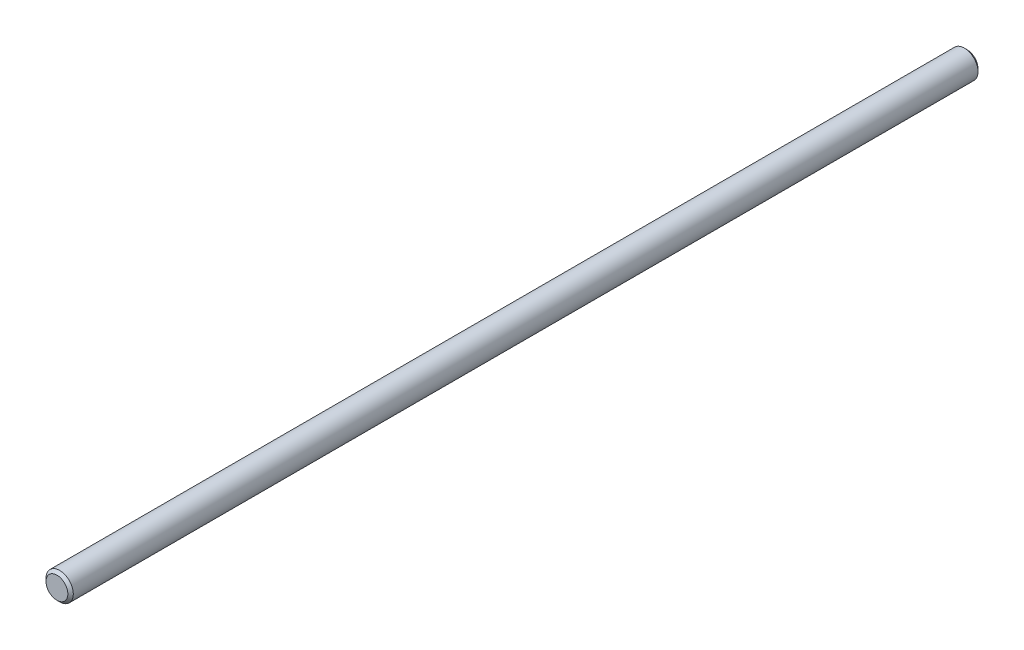
ISO-10303-21;
HEADER;
FILE_DESCRIPTION(('STEP AP214'),'2;1');
FILE_NAME('part.step','',(''),(''),'','','');
FILE_SCHEMA(('AUTOMOTIVE_DESIGN { 1 0 10303 214 1 1 1 1 }'));
ENDSEC;
DATA;
#1=APPLICATION_CONTEXT('core data for automotive mechanical design processes');
#2=APPLICATION_PROTOCOL_DEFINITION('international standard','automotive_design',2000,#1);
#3=PRODUCT_CONTEXT('',#1,'mechanical');
#4=PRODUCT('Part','Part','',(#3));
#5=PRODUCT_RELATED_PRODUCT_CATEGORY('part','',(#4));
#6=PRODUCT_DEFINITION_FORMATION('','',#4);
#7=PRODUCT_DEFINITION_CONTEXT('part definition',#1,'design');
#8=PRODUCT_DEFINITION('design','',#6,#7);
#9=PRODUCT_DEFINITION_SHAPE('','',#8);
#10=(LENGTH_UNIT() NAMED_UNIT(*) SI_UNIT(.MILLI.,.METRE.));
#11=(NAMED_UNIT(*) PLANE_ANGLE_UNIT() SI_UNIT($,.RADIAN.));
#12=(NAMED_UNIT(*) SI_UNIT($,.STERADIAN.) SOLID_ANGLE_UNIT());
#13=UNCERTAINTY_MEASURE_WITH_UNIT(LENGTH_MEASURE(1.E-05),#10,'distance_accuracy_value','');
#14=(GEOMETRIC_REPRESENTATION_CONTEXT(3) GLOBAL_UNCERTAINTY_ASSIGNED_CONTEXT((#13)) GLOBAL_UNIT_ASSIGNED_CONTEXT((#10,
#11,#12)) REPRESENTATION_CONTEXT('',''));
#15=CARTESIAN_POINT('',(0.,0.,0.));
#16=DIRECTION('',(0.,0.,1.));
#17=DIRECTION('',(1.,0.,0.));
#18=AXIS2_PLACEMENT_3D('',#15,#16,#17);
#19=CARTESIAN_POINT('',(0.,0.,200.));
#20=DIRECTION('',(0.,0.,-1.));
#21=DIRECTION('',(-1.,0.,0.));
#22=AXIS2_PLACEMENT_3D('',#19,#20,#21);
#23=CYLINDRICAL_SURFACE('',#22,6.);
#24=CARTESIAN_POINT('',(0.,0.,-198.8));
#25=DIRECTION('',(0.,0.,1.));
#26=DIRECTION('',(1.,0.,0.));
#27=AXIS2_PLACEMENT_3D('',#24,#25,#26);
#28=CIRCLE('',#27,6.);
#29=CARTESIAN_POINT('',(6.,0.,-198.8));
#30=VERTEX_POINT('',#29);
#31=EDGE_CURVE('E41',#30,#30,#28,.T.);
#32=ORIENTED_EDGE('',*,*,#31,.T.);
#33=EDGE_LOOP('',(#32));
#34=FACE_BOUND('',#33,.T.);
#35=CARTESIAN_POINT('',(0.,0.,198.8));
#36=DIRECTION('',(0.,0.,1.));
#37=DIRECTION('',(1.,0.,0.));
#38=AXIS2_PLACEMENT_3D('',#35,#36,#37);
#39=CIRCLE('',#38,6.);
#40=CARTESIAN_POINT('',(6.,0.,198.8));
#41=VERTEX_POINT('',#40);
#42=EDGE_CURVE('E45',#41,#41,#39,.F.);
#43=ORIENTED_EDGE('',*,*,#42,.T.);
#44=EDGE_LOOP('',(#43));
#45=FACE_BOUND('',#44,.T.);
#46=ADVANCED_FACE('F30',(#34,#45),#23,.T.);
#47=CARTESIAN_POINT('',(0.,0.,200.));
#48=DIRECTION('',(0.,0.,1.));
#49=DIRECTION('',(1.,0.,0.));
#50=AXIS2_PLACEMENT_3D('',#47,#48,#49);
#51=PLANE('',#50);
#52=CARTESIAN_POINT('',(0.,0.,200.));
#53=DIRECTION('',(0.,0.,1.));
#54=DIRECTION('',(1.,0.,0.));
#55=AXIS2_PLACEMENT_3D('',#52,#53,#54);
#56=CIRCLE('',#55,4.80000000000008);
#57=CARTESIAN_POINT('',(4.80000000000008,0.,200.));
#58=VERTEX_POINT('',#57);
#59=EDGE_CURVE('E10',#58,#58,#56,.T.);
#60=ORIENTED_EDGE('',*,*,#59,.T.);
#61=EDGE_LOOP('',(#60));
#62=FACE_BOUND('',#61,.T.);
#63=ADVANCED_FACE('F61',(#62),#51,.T.);
#64=CARTESIAN_POINT('',(0.,0.,-200.));
#65=DIRECTION('',(0.,0.,1.));
#66=DIRECTION('',(1.,0.,0.));
#67=AXIS2_PLACEMENT_3D('',#64,#65,#66);
#68=PLANE('',#67);
#69=CARTESIAN_POINT('',(0.,0.,-200.));
#70=DIRECTION('',(0.,0.,1.));
#71=DIRECTION('',(1.,0.,0.));
#72=AXIS2_PLACEMENT_3D('',#69,#70,#71);
#73=CIRCLE('',#72,4.79999999999992);
#74=CARTESIAN_POINT('',(4.79999999999992,0.,-200.));
#75=VERTEX_POINT('',#74);
#76=EDGE_CURVE('E37',#75,#75,#73,.F.);
#77=ORIENTED_EDGE('',*,*,#76,.T.);
#78=EDGE_LOOP('',(#77));
#79=FACE_BOUND('',#78,.T.);
#80=ADVANCED_FACE('F58',(#79),#68,.F.);
#81=CARTESIAN_POINT('',(0.,0.,-198.8));
#82=DIRECTION('',(0.,0.,1.));
#83=DIRECTION('',(1.,0.,0.));
#84=AXIS2_PLACEMENT_3D('',#81,#82,#83);
#85=CONICAL_SURFACE('',#84,6.,0.785398163397447);
#86=ORIENTED_EDGE('',*,*,#76,.F.);
#87=EDGE_LOOP('',(#86));
#88=FACE_BOUND('',#87,.T.);
#89=ORIENTED_EDGE('',*,*,#31,.F.);
#90=EDGE_LOOP('',(#89));
#91=FACE_BOUND('',#90,.T.);
#92=ADVANCED_FACE('F54',(#88,#91),#85,.T.);
#93=CARTESIAN_POINT('',(0.,0.,200.));
#94=DIRECTION('',(0.,0.,-1.));
#95=DIRECTION('',(-1.,0.,0.));
#96=AXIS2_PLACEMENT_3D('',#93,#94,#95);
#97=CONICAL_SURFACE('',#96,4.80000000000008,0.785398163397435);
#98=ORIENTED_EDGE('',*,*,#42,.F.);
#99=EDGE_LOOP('',(#98));
#100=FACE_BOUND('',#99,.T.);
#101=ORIENTED_EDGE('',*,*,#59,.F.);
#102=EDGE_LOOP('',(#101));
#103=FACE_BOUND('',#102,.T.);
#104=ADVANCED_FACE('F32',(#100,#103),#97,.T.);
#105=CLOSED_SHELL('',(#46,#63,#80,#92,#104));
#106=MANIFOLD_SOLID_BREP('B2',#105);
#107=ADVANCED_BREP_SHAPE_REPRESENTATION('',(#18,#106),#14);
#108=SHAPE_DEFINITION_REPRESENTATION(#9,#107);
ENDSEC;
END-ISO-10303-21;
